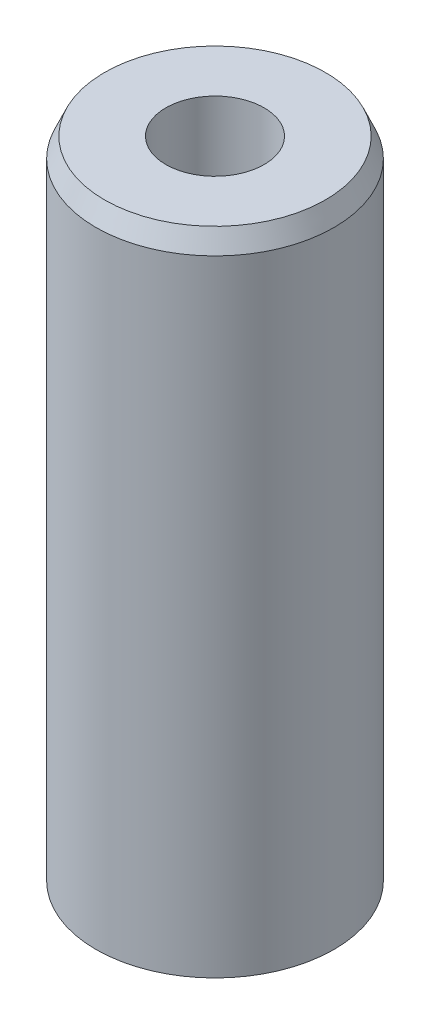
ISO-10303-21;
HEADER;
FILE_DESCRIPTION(('STEP AP214'),'2;1');
FILE_NAME('part.step','',(''),(''),'','','');
FILE_SCHEMA(('AUTOMOTIVE_DESIGN { 1 0 10303 214 1 1 1 1 }'));
ENDSEC;
DATA;
#1=APPLICATION_CONTEXT('core data for automotive mechanical design processes');
#2=APPLICATION_PROTOCOL_DEFINITION('international standard','automotive_design',2000,#1);
#3=PRODUCT_CONTEXT('',#1,'mechanical');
#4=PRODUCT('Part','Part','',(#3));
#5=PRODUCT_RELATED_PRODUCT_CATEGORY('part','',(#4));
#6=PRODUCT_DEFINITION_FORMATION('','',#4);
#7=PRODUCT_DEFINITION_CONTEXT('part definition',#1,'design');
#8=PRODUCT_DEFINITION('design','',#6,#7);
#9=PRODUCT_DEFINITION_SHAPE('','',#8);
#10=(LENGTH_UNIT() NAMED_UNIT(*) SI_UNIT(.MILLI.,.METRE.));
#11=(NAMED_UNIT(*) PLANE_ANGLE_UNIT() SI_UNIT($,.RADIAN.));
#12=(NAMED_UNIT(*) SI_UNIT($,.STERADIAN.) SOLID_ANGLE_UNIT());
#13=UNCERTAINTY_MEASURE_WITH_UNIT(LENGTH_MEASURE(1.E-05),#10,'distance_accuracy_value','');
#14=(GEOMETRIC_REPRESENTATION_CONTEXT(3) GLOBAL_UNCERTAINTY_ASSIGNED_CONTEXT((#13)) GLOBAL_UNIT_ASSIGNED_CONTEXT((#10,
#11,#12)) REPRESENTATION_CONTEXT('',''));
#15=CARTESIAN_POINT('',(0.,0.,0.));
#16=DIRECTION('',(0.,0.,1.));
#17=DIRECTION('',(1.,0.,0.));
#18=AXIS2_PLACEMENT_3D('',#15,#16,#17);
#19=CARTESIAN_POINT('',(0.,137.203772064837,0.));
#20=DIRECTION('',(0.,-1.,0.));
#21=DIRECTION('',(0.,0.,-1.));
#22=AXIS2_PLACEMENT_3D('',#19,#20,#21);
#23=CYLINDRICAL_SURFACE('',#22,25.);
#24=CARTESIAN_POINT('',(0.,133.096324147502,0.));
#25=DIRECTION('',(0.,1.,0.));
#26=DIRECTION('',(0.,0.,1.));
#27=AXIS2_PLACEMENT_3D('',#24,#25,#26);
#28=CIRCLE('',#27,25.);
#29=CARTESIAN_POINT('',(0.,133.096324147502,25.));
#30=VERTEX_POINT('',#29);
#31=EDGE_CURVE('E50',#30,#30,#28,.F.);
#32=ORIENTED_EDGE('',*,*,#31,.T.);
#33=EDGE_LOOP('',(#32));
#34=FACE_BOUND('',#33,.T.);
#35=CARTESIAN_POINT('',(0.,1.81172378761404,0.));
#36=DIRECTION('',(0.,1.,0.));
#37=DIRECTION('',(0.,0.,1.));
#38=AXIS2_PLACEMENT_3D('',#35,#36,#37);
#39=CIRCLE('',#38,25.);
#40=CARTESIAN_POINT('',(0.,1.81172378761404,25.));
#41=VERTEX_POINT('',#40);
#42=EDGE_CURVE('E51',#41,#41,#39,.T.);
#43=ORIENTED_EDGE('',*,*,#42,.T.);
#44=EDGE_LOOP('',(#43));
#45=FACE_BOUND('',#44,.T.);
#46=ADVANCED_FACE('F39',(#34,#45),#23,.T.);
#47=CARTESIAN_POINT('',(0.,137.203772064837,0.));
#48=DIRECTION('',(0.,1.,0.));
#49=DIRECTION('',(0.,0.,1.));
#50=AXIS2_PLACEMENT_3D('',#47,#48,#49);
#51=PLANE('',#50);
#52=CARTESIAN_POINT('',(0.,137.203772064837,0.));
#53=DIRECTION('',(0.,1.,0.));
#54=DIRECTION('',(0.,0.,1.));
#55=AXIS2_PLACEMENT_3D('',#52,#53,#54);
#56=CIRCLE('',#55,23.188276212386);
#57=CARTESIAN_POINT('',(0.,137.203772064837,23.188276212386));
#58=VERTEX_POINT('',#57);
#59=EDGE_CURVE('E54',#58,#58,#56,.T.);
#60=ORIENTED_EDGE('',*,*,#59,.T.);
#61=EDGE_LOOP('',(#60));
#62=FACE_BOUND('',#61,.T.);
#63=CARTESIAN_POINT('',(0.,137.203772064837,0.));
#64=DIRECTION('',(0.,1.,0.));
#65=DIRECTION('',(0.,0.,1.));
#66=AXIS2_PLACEMENT_3D('',#63,#64,#65);
#67=CIRCLE('',#66,10.3259550091967);
#68=CARTESIAN_POINT('',(0.,137.203772064837,10.3259550091967));
#69=VERTEX_POINT('',#68);
#70=EDGE_CURVE('E58',#69,#69,#67,.T.);
#71=ORIENTED_EDGE('',*,*,#70,.F.);
#72=EDGE_LOOP('',(#71));
#73=FACE_BOUND('',#72,.T.);
#74=ADVANCED_FACE('F69',(#62,#73),#51,.T.);
#75=CARTESIAN_POINT('',(0.,0.,0.));
#76=DIRECTION('',(0.,1.,0.));
#77=DIRECTION('',(0.,0.,1.));
#78=AXIS2_PLACEMENT_3D('',#75,#76,#77);
#79=PLANE('',#78);
#80=CARTESIAN_POINT('',(0.,0.,0.));
#81=DIRECTION('',(0.,1.,0.));
#82=DIRECTION('',(0.,0.,1.));
#83=AXIS2_PLACEMENT_3D('',#80,#81,#82);
#84=CIRCLE('',#83,20.8925520826654);
#85=CARTESIAN_POINT('',(0.,0.,20.8925520826654));
#86=VERTEX_POINT('',#85);
#87=EDGE_CURVE('E10',#86,#86,#84,.F.);
#88=ORIENTED_EDGE('',*,*,#87,.T.);
#89=EDGE_LOOP('',(#88));
#90=FACE_BOUND('',#89,.T.);
#91=CARTESIAN_POINT('',(0.,0.,0.));
#92=DIRECTION('',(0.,1.,0.));
#93=DIRECTION('',(0.,0.,1.));
#94=AXIS2_PLACEMENT_3D('',#91,#92,#93);
#95=CIRCLE('',#94,10.3259550091967);
#96=CARTESIAN_POINT('',(0.,0.,10.3259550091967));
#97=VERTEX_POINT('',#96);
#98=EDGE_CURVE('E63',#97,#97,#95,.T.);
#99=ORIENTED_EDGE('',*,*,#98,.T.);
#100=EDGE_LOOP('',(#99));
#101=FACE_BOUND('',#100,.T.);
#102=ADVANCED_FACE('F75',(#90,#101),#79,.F.);
#103=CARTESIAN_POINT('',(0.,137.203772064837,0.));
#104=DIRECTION('',(0.,-1.,0.));
#105=DIRECTION('',(0.,0.,-1.));
#106=AXIS2_PLACEMENT_3D('',#103,#104,#105);
#107=CYLINDRICAL_SURFACE('',#106,10.3259550091967);
#108=ORIENTED_EDGE('',*,*,#70,.T.);
#109=EDGE_LOOP('',(#108));
#110=FACE_BOUND('',#109,.T.);
#111=ORIENTED_EDGE('',*,*,#98,.F.);
#112=EDGE_LOOP('',(#111));
#113=FACE_BOUND('',#112,.T.);
#114=ADVANCED_FACE('F70',(#110,#113),#107,.F.);
#115=CARTESIAN_POINT('',(0.,137.203772064837,0.));
#116=DIRECTION('',(0.,-1.,0.));
#117=DIRECTION('',(0.,0.,-1.));
#118=AXIS2_PLACEMENT_3D('',#115,#116,#117);
#119=CONICAL_SURFACE('',#118,23.188276212386,0.415413512634901);
#120=ORIENTED_EDGE('',*,*,#31,.F.);
#121=EDGE_LOOP('',(#120));
#122=FACE_BOUND('',#121,.T.);
#123=ORIENTED_EDGE('',*,*,#59,.F.);
#124=EDGE_LOOP('',(#123));
#125=FACE_BOUND('',#124,.T.);
#126=ADVANCED_FACE('F81',(#122,#125),#119,.T.);
#127=CARTESIAN_POINT('',(0.,1.81172378761404,0.));
#128=DIRECTION('',(0.,1.,0.));
#129=DIRECTION('',(0.,0.,1.));
#130=AXIS2_PLACEMENT_3D('',#127,#128,#129);
#131=CONICAL_SURFACE('',#130,25.,1.15538281416);
#132=ORIENTED_EDGE('',*,*,#87,.F.);
#133=EDGE_LOOP('',(#132));
#134=FACE_BOUND('',#133,.T.);
#135=ORIENTED_EDGE('',*,*,#42,.F.);
#136=EDGE_LOOP('',(#135));
#137=FACE_BOUND('',#136,.T.);
#138=ADVANCED_FACE('F45',(#134,#137),#131,.T.);
#139=CLOSED_SHELL('',(#46,#74,#102,#114,#126,#138));
#140=MANIFOLD_SOLID_BREP('B2',#139);
#141=ADVANCED_BREP_SHAPE_REPRESENTATION('',(#18,#140),#14);
#142=SHAPE_DEFINITION_REPRESENTATION(#9,#141);
ENDSEC;
END-ISO-10303-21;
